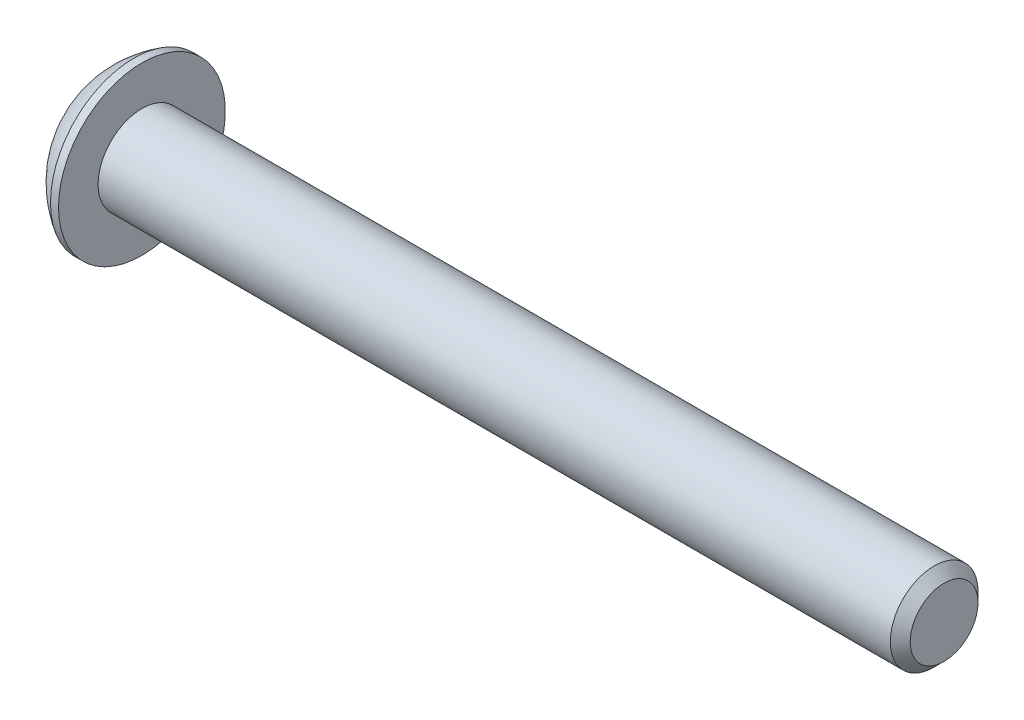
ISO-10303-21;
HEADER;
FILE_DESCRIPTION(('STEP AP214'),'2;1');
FILE_NAME('part.step','',(''),(''),'','','');
FILE_SCHEMA(('AUTOMOTIVE_DESIGN { 1 0 10303 214 1 1 1 1 }'));
ENDSEC;
DATA;
#1=APPLICATION_CONTEXT('core data for automotive mechanical design processes');
#2=APPLICATION_PROTOCOL_DEFINITION('international standard','automotive_design',2000,#1);
#3=PRODUCT_CONTEXT('',#1,'mechanical');
#4=PRODUCT('Part','Part','',(#3));
#5=PRODUCT_RELATED_PRODUCT_CATEGORY('part','',(#4));
#6=PRODUCT_DEFINITION_FORMATION('','',#4);
#7=PRODUCT_DEFINITION_CONTEXT('part definition',#1,'design');
#8=PRODUCT_DEFINITION('design','',#6,#7);
#9=PRODUCT_DEFINITION_SHAPE('','',#8);
#10=(LENGTH_UNIT() NAMED_UNIT(*) SI_UNIT(.MILLI.,.METRE.));
#11=(NAMED_UNIT(*) PLANE_ANGLE_UNIT() SI_UNIT($,.RADIAN.));
#12=(NAMED_UNIT(*) SI_UNIT($,.STERADIAN.) SOLID_ANGLE_UNIT());
#13=UNCERTAINTY_MEASURE_WITH_UNIT(LENGTH_MEASURE(1.E-05),#10,'distance_accuracy_value','');
#14=(GEOMETRIC_REPRESENTATION_CONTEXT(3) GLOBAL_UNCERTAINTY_ASSIGNED_CONTEXT((#13)) GLOBAL_UNIT_ASSIGNED_CONTEXT((#10,
#11,#12)) REPRESENTATION_CONTEXT('',''));
#15=CARTESIAN_POINT('',(0.,0.,0.));
#16=DIRECTION('',(0.,0.,1.));
#17=DIRECTION('',(1.,0.,0.));
#18=AXIS2_PLACEMENT_3D('',#15,#16,#17);
#19=CARTESIAN_POINT('',(1.32080000000034,0.,0.));
#20=DIRECTION('',(-1.,0.,0.));
#21=DIRECTION('',(0.,0.,1.));
#22=AXIS2_PLACEMENT_3D('',#19,#20,#21);
#23=CONICAL_SURFACE('',#22,1.1937999999998,1.04719755119608);
#24=CARTESIAN_POINT('',(2.01004075135902,0.,4.44089209850063E-13));
#25=VERTEX_POINT('',#24);
#26=VERTEX_LOOP('',#25);
#27=FACE_BOUND('',#26,.T.);
#28=CARTESIAN_POINT('',(1.32080000000009,0.,0.));
#29=DIRECTION('',(-1.,0.,0.));
#30=DIRECTION('',(0.,0.,1.));
#31=AXIS2_PLACEMENT_3D('',#28,#29,#30);
#32=CIRCLE('',#31,1.19380000000024);
#33=CARTESIAN_POINT('',(1.32080000000004,-1.03386112703797,0.59690000000006));
#34=VERTEX_POINT('',#33);
#35=CARTESIAN_POINT('',(1.32080000000004,0.,1.19380000000012));
#36=VERTEX_POINT('',#35);
#37=EDGE_CURVE('E20',#34,#36,#32,.T.);
#38=ORIENTED_EDGE('',*,*,#37,.T.);
#39=CARTESIAN_POINT('',(1.32080000000009,0.,0.));
#40=DIRECTION('',(-1.,0.,0.));
#41=DIRECTION('',(0.,0.,1.));
#42=AXIS2_PLACEMENT_3D('',#39,#40,#41);
#43=CIRCLE('',#42,1.19380000000024);
#44=CARTESIAN_POINT('',(1.32080000000004,1.03386112703797,0.596900000000061));
#45=VERTEX_POINT('',#44);
#46=EDGE_CURVE('E148',#36,#45,#43,.T.);
#47=ORIENTED_EDGE('',*,*,#46,.T.);
#48=CARTESIAN_POINT('',(1.32080000000009,0.,0.));
#49=DIRECTION('',(-1.,0.,0.));
#50=DIRECTION('',(0.,0.,1.));
#51=AXIS2_PLACEMENT_3D('',#48,#49,#50);
#52=CIRCLE('',#51,1.19380000000024);
#53=CARTESIAN_POINT('',(1.32080000000004,1.03386112703797,-0.596900000000061));
#54=VERTEX_POINT('',#53);
#55=EDGE_CURVE('E448',#45,#54,#52,.T.);
#56=ORIENTED_EDGE('',*,*,#55,.T.);
#57=CARTESIAN_POINT('',(1.32080000000009,0.,0.));
#58=DIRECTION('',(-1.,0.,0.));
#59=DIRECTION('',(0.,0.,1.));
#60=AXIS2_PLACEMENT_3D('',#57,#58,#59);
#61=CIRCLE('',#60,1.19380000000024);
#62=CARTESIAN_POINT('',(1.32080000000004,1.49457637585666E-12,-1.19380000000012));
#63=VERTEX_POINT('',#62);
#64=EDGE_CURVE('E449',#54,#63,#61,.T.);
#65=ORIENTED_EDGE('',*,*,#64,.T.);
#66=CARTESIAN_POINT('',(1.32080000000009,0.,0.));
#67=DIRECTION('',(-1.,0.,0.));
#68=DIRECTION('',(0.,0.,1.));
#69=AXIS2_PLACEMENT_3D('',#66,#67,#68);
#70=CIRCLE('',#69,1.19380000000024);
#71=CARTESIAN_POINT('',(1.32080000000004,-1.03386112703797,-0.59690000000006));
#72=VERTEX_POINT('',#71);
#73=EDGE_CURVE('E93',#63,#72,#70,.T.);
#74=ORIENTED_EDGE('',*,*,#73,.T.);
#75=CARTESIAN_POINT('',(1.32080000000009,0.,0.));
#76=DIRECTION('',(-1.,0.,0.));
#77=DIRECTION('',(0.,0.,1.));
#78=AXIS2_PLACEMENT_3D('',#75,#76,#77);
#79=CIRCLE('',#78,1.19380000000024);
#80=EDGE_CURVE('E89',#72,#34,#79,.T.);
#81=ORIENTED_EDGE('',*,*,#80,.T.);
#82=EDGE_LOOP('',(#38,#47,#56,#65,#74,#81));
#83=FACE_BOUND('',#82,.T.);
#84=ADVANCED_FACE('F17',(#27,#83),#23,.F.);
#85=CARTESIAN_POINT('',(1.3208,-2.06772225407572,-1.1938));
#86=DIRECTION('',(1.,0.,0.));
#87=DIRECTION('',(0.,0.,-1.));
#88=AXIS2_PLACEMENT_3D('',#85,#86,#87);
#89=PLANE('',#88);
#90=DIRECTION('',(0.,0.5,0.866025403784439));
#91=VECTOR('',#90,1.);
#92=CARTESIAN_POINT('',(1.3208,-1.37848150271715,0.));
#93=LINE('',#92,#91);
#94=CARTESIAN_POINT('',(1.3208,-0.689240751358574,1.1938));
#95=VERTEX_POINT('',#94);
#96=EDGE_CURVE('E101',#95,#34,#93,.F.);
#97=ORIENTED_EDGE('',*,*,#96,.F.);
#98=DIRECTION('',(0.,1.,0.));
#99=VECTOR('',#98,1.);
#100=CARTESIAN_POINT('',(1.3208,-0.689240751358574,1.1938));
#101=LINE('',#100,#99);
#102=EDGE_CURVE('E103',#36,#95,#101,.F.);
#103=ORIENTED_EDGE('',*,*,#102,.F.);
#104=ORIENTED_EDGE('',*,*,#37,.F.);
#105=EDGE_LOOP('',(#97,#103,#104));
#106=FACE_BOUND('',#105,.T.);
#107=ADVANCED_FACE('F99',(#106),#89,.F.);
#108=CARTESIAN_POINT('',(1.3208,-2.06772225407572,-1.1938));
#109=DIRECTION('',(1.,0.,0.));
#110=DIRECTION('',(0.,0.,-1.));
#111=AXIS2_PLACEMENT_3D('',#108,#109,#110);
#112=PLANE('',#111);
#113=DIRECTION('',(0.,-0.5,0.866025403784439));
#114=VECTOR('',#113,1.);
#115=CARTESIAN_POINT('',(1.3208,-0.689240751358574,-1.1938));
#116=LINE('',#115,#114);
#117=CARTESIAN_POINT('',(1.3208,-1.37848150271715,0.));
#118=VERTEX_POINT('',#117);
#119=EDGE_CURVE('E109',#118,#72,#116,.F.);
#120=ORIENTED_EDGE('',*,*,#119,.F.);
#121=DIRECTION('',(0.,0.5,0.866025403784439));
#122=VECTOR('',#121,1.);
#123=CARTESIAN_POINT('',(1.3208,-1.37848150271715,0.));
#124=LINE('',#123,#122);
#125=EDGE_CURVE('E106',#34,#118,#124,.F.);
#126=ORIENTED_EDGE('',*,*,#125,.F.);
#127=ORIENTED_EDGE('',*,*,#80,.F.);
#128=EDGE_LOOP('',(#120,#126,#127));
#129=FACE_BOUND('',#128,.T.);
#130=ADVANCED_FACE('F107',(#129),#112,.F.);
#131=CARTESIAN_POINT('',(1.3208,-2.06772225407572,-1.1938));
#132=DIRECTION('',(1.,0.,0.));
#133=DIRECTION('',(0.,0.,-1.));
#134=AXIS2_PLACEMENT_3D('',#131,#132,#133);
#135=PLANE('',#134);
#136=DIRECTION('',(0.,1.,0.));
#137=VECTOR('',#136,1.);
#138=CARTESIAN_POINT('',(1.3208,0.689240751358577,-1.1938));
#139=LINE('',#138,#137);
#140=CARTESIAN_POINT('',(1.3208,-0.689240751358574,-1.1938));
#141=VERTEX_POINT('',#140);
#142=EDGE_CURVE('E419',#141,#63,#139,.T.);
#143=ORIENTED_EDGE('',*,*,#142,.F.);
#144=DIRECTION('',(0.,-0.5,0.866025403784439));
#145=VECTOR('',#144,1.);
#146=CARTESIAN_POINT('',(1.3208,-0.689240751358574,-1.1938));
#147=LINE('',#146,#145);
#148=EDGE_CURVE('E431',#72,#141,#147,.F.);
#149=ORIENTED_EDGE('',*,*,#148,.F.);
#150=ORIENTED_EDGE('',*,*,#73,.F.);
#151=EDGE_LOOP('',(#143,#149,#150));
#152=FACE_BOUND('',#151,.T.);
#153=ADVANCED_FACE('F191',(#152),#135,.F.);
#154=CARTESIAN_POINT('',(1.3208,-2.06772225407572,-1.1938));
#155=DIRECTION('',(1.,0.,0.));
#156=DIRECTION('',(0.,0.,-1.));
#157=AXIS2_PLACEMENT_3D('',#154,#155,#156);
#158=PLANE('',#157);
#159=DIRECTION('',(0.,-0.5,-0.866025403784439));
#160=VECTOR('',#159,1.);
#161=CARTESIAN_POINT('',(1.3208,1.37848150271715,0.));
#162=LINE('',#161,#160);
#163=CARTESIAN_POINT('',(1.3208,0.689240751358577,-1.1938));
#164=VERTEX_POINT('',#163);
#165=EDGE_CURVE('E405',#164,#54,#162,.F.);
#166=ORIENTED_EDGE('',*,*,#165,.F.);
#167=DIRECTION('',(0.,1.,0.));
#168=VECTOR('',#167,1.);
#169=CARTESIAN_POINT('',(1.3208,0.689240751358577,-1.1938));
#170=LINE('',#169,#168);
#171=EDGE_CURVE('E416',#63,#164,#170,.T.);
#172=ORIENTED_EDGE('',*,*,#171,.F.);
#173=ORIENTED_EDGE('',*,*,#64,.F.);
#174=EDGE_LOOP('',(#166,#172,#173));
#175=FACE_BOUND('',#174,.T.);
#176=ADVANCED_FACE('F187',(#175),#158,.F.);
#177=CARTESIAN_POINT('',(1.3208,-2.06772225407572,-1.1938));
#178=DIRECTION('',(1.,0.,0.));
#179=DIRECTION('',(0.,0.,-1.));
#180=AXIS2_PLACEMENT_3D('',#177,#178,#179);
#181=PLANE('',#180);
#182=DIRECTION('',(0.,0.5,-0.866025403784439));
#183=VECTOR('',#182,1.);
#184=CARTESIAN_POINT('',(1.3208,0.689240751358576,1.1938));
#185=LINE('',#184,#183);
#186=CARTESIAN_POINT('',(1.3208,1.37848150271715,0.));
#187=VERTEX_POINT('',#186);
#188=EDGE_CURVE('E384',#187,#45,#185,.F.);
#189=ORIENTED_EDGE('',*,*,#188,.F.);
#190=DIRECTION('',(0.,-0.5,-0.866025403784439));
#191=VECTOR('',#190,1.);
#192=CARTESIAN_POINT('',(1.3208,1.37848150271715,0.));
#193=LINE('',#192,#191);
#194=EDGE_CURVE('E403',#54,#187,#193,.F.);
#195=ORIENTED_EDGE('',*,*,#194,.F.);
#196=ORIENTED_EDGE('',*,*,#55,.F.);
#197=EDGE_LOOP('',(#189,#195,#196));
#198=FACE_BOUND('',#197,.T.);
#199=ADVANCED_FACE('F183',(#198),#181,.F.);
#200=CARTESIAN_POINT('',(1.3208,-2.06772225407572,-1.1938));
#201=DIRECTION('',(1.,0.,0.));
#202=DIRECTION('',(0.,0.,-1.));
#203=AXIS2_PLACEMENT_3D('',#200,#201,#202);
#204=PLANE('',#203);
#205=DIRECTION('',(0.,1.,0.));
#206=VECTOR('',#205,1.);
#207=CARTESIAN_POINT('',(1.3208,-0.689240751358574,1.1938));
#208=LINE('',#207,#206);
#209=CARTESIAN_POINT('',(1.3208,0.689240751358576,1.1938));
#210=VERTEX_POINT('',#209);
#211=EDGE_CURVE('E118',#210,#36,#208,.F.);
#212=ORIENTED_EDGE('',*,*,#211,.F.);
#213=DIRECTION('',(0.,0.5,-0.866025403784439));
#214=VECTOR('',#213,1.);
#215=CARTESIAN_POINT('',(1.3208,0.689240751358576,1.1938));
#216=LINE('',#215,#214);
#217=EDGE_CURVE('E387',#45,#210,#216,.F.);
#218=ORIENTED_EDGE('',*,*,#217,.F.);
#219=ORIENTED_EDGE('',*,*,#46,.F.);
#220=EDGE_LOOP('',(#212,#218,#219));
#221=FACE_BOUND('',#220,.T.);
#222=ADVANCED_FACE('F179',(#221),#204,.F.);
#223=CARTESIAN_POINT('',(1.3208,-0.689240751358574,1.1938));
#224=DIRECTION('',(0.,0.,-1.));
#225=DIRECTION('',(0.,1.,0.));
#226=AXIS2_PLACEMENT_3D('',#223,#224,#225);
#227=PLANE('',#226);
#228=DIRECTION('',(0.,1.,0.));
#229=VECTOR('',#228,1.);
#230=CARTESIAN_POINT('',(0.,0.,1.1938));
#231=LINE('',#230,#229);
#232=CARTESIAN_POINT('',(0.,0.689240751358577,1.1938));
#233=VERTEX_POINT('',#232);
#234=CARTESIAN_POINT('',(0.,-0.689240751358574,1.1938));
#235=VERTEX_POINT('',#234);
#236=EDGE_CURVE('E381',#233,#235,#231,.F.);
#237=ORIENTED_EDGE('',*,*,#236,.F.);
#238=DIRECTION('',(1.,0.,0.));
#239=VECTOR('',#238,1.);
#240=CARTESIAN_POINT('',(1.3208,0.689240751358576,1.1938));
#241=LINE('',#240,#239);
#242=EDGE_CURVE('E393',#210,#233,#241,.F.);
#243=ORIENTED_EDGE('',*,*,#242,.F.);
#244=ORIENTED_EDGE('',*,*,#211,.T.);
#245=ORIENTED_EDGE('',*,*,#102,.T.);
#246=DIRECTION('',(1.,0.,0.));
#247=VECTOR('',#246,1.);
#248=CARTESIAN_POINT('',(1.3208,-0.689240751358574,1.1938));
#249=LINE('',#248,#247);
#250=EDGE_CURVE('E112',#235,#95,#249,.T.);
#251=ORIENTED_EDGE('',*,*,#250,.F.);
#252=EDGE_LOOP('',(#237,#243,#244,#245,#251));
#253=FACE_BOUND('',#252,.T.);
#254=ADVANCED_FACE('F176',(#253),#227,.T.);
#255=CARTESIAN_POINT('',(1.3208,-1.37848150271715,0.));
#256=DIRECTION('',(0.,0.866025403784439,-0.5));
#257=DIRECTION('',(0.,0.5,0.866025403784439));
#258=AXIS2_PLACEMENT_3D('',#255,#256,#257);
#259=PLANE('',#258);
#260=DIRECTION('',(0.,-0.5,-0.866025403784439));
#261=VECTOR('',#260,1.);
#262=CARTESIAN_POINT('',(0.,-0.689240751358574,1.1938));
#263=LINE('',#262,#261);
#264=CARTESIAN_POINT('',(0.,-1.37848150271715,0.));
#265=VERTEX_POINT('',#264);
#266=EDGE_CURVE('E378',#235,#265,#263,.T.);
#267=ORIENTED_EDGE('',*,*,#266,.F.);
#268=ORIENTED_EDGE('',*,*,#250,.T.);
#269=ORIENTED_EDGE('',*,*,#96,.T.);
#270=ORIENTED_EDGE('',*,*,#125,.T.);
#271=DIRECTION('',(1.,0.,0.));
#272=VECTOR('',#271,1.);
#273=CARTESIAN_POINT('',(1.3208,-1.37848150271715,0.));
#274=LINE('',#273,#272);
#275=EDGE_CURVE('E428',#265,#118,#274,.T.);
#276=ORIENTED_EDGE('',*,*,#275,.F.);
#277=EDGE_LOOP('',(#267,#268,#269,#270,#276));
#278=FACE_BOUND('',#277,.T.);
#279=ADVANCED_FACE('F116',(#278),#259,.T.);
#280=CARTESIAN_POINT('',(1.3208,-0.689240751358574,-1.1938));
#281=DIRECTION('',(0.,0.866025403784439,0.5));
#282=DIRECTION('',(0.,-0.5,0.866025403784439));
#283=AXIS2_PLACEMENT_3D('',#280,#281,#282);
#284=PLANE('',#283);
#285=DIRECTION('',(0.,0.5,-0.866025403784439));
#286=VECTOR('',#285,1.);
#287=CARTESIAN_POINT('',(0.,-1.37848150271715,0.));
#288=LINE('',#287,#286);
#289=CARTESIAN_POINT('',(0.,-0.689240751358574,-1.1938));
#290=VERTEX_POINT('',#289);
#291=EDGE_CURVE('E375',#265,#290,#288,.T.);
#292=ORIENTED_EDGE('',*,*,#291,.F.);
#293=ORIENTED_EDGE('',*,*,#275,.T.);
#294=ORIENTED_EDGE('',*,*,#119,.T.);
#295=ORIENTED_EDGE('',*,*,#148,.T.);
#296=DIRECTION('',(1.,0.,0.));
#297=VECTOR('',#296,1.);
#298=CARTESIAN_POINT('',(1.3208,-0.689240751358574,-1.1938));
#299=LINE('',#298,#297);
#300=EDGE_CURVE('E413',#290,#141,#299,.T.);
#301=ORIENTED_EDGE('',*,*,#300,.F.);
#302=EDGE_LOOP('',(#292,#293,#294,#295,#301));
#303=FACE_BOUND('',#302,.T.);
#304=ADVANCED_FACE('F169',(#303),#284,.T.);
#305=CARTESIAN_POINT('',(1.3208,0.689240751358577,-1.1938));
#306=DIRECTION('',(0.,0.,1.));
#307=DIRECTION('',(1.,0.,0.));
#308=AXIS2_PLACEMENT_3D('',#305,#306,#307);
#309=PLANE('',#308);
#310=DIRECTION('',(0.,1.,0.));
#311=VECTOR('',#310,1.);
#312=CARTESIAN_POINT('',(0.,0.,-1.1938));
#313=LINE('',#312,#311);
#314=CARTESIAN_POINT('',(0.,0.689240751358577,-1.1938));
#315=VERTEX_POINT('',#314);
#316=EDGE_CURVE('E372',#290,#315,#313,.T.);
#317=ORIENTED_EDGE('',*,*,#316,.F.);
#318=ORIENTED_EDGE('',*,*,#300,.T.);
#319=ORIENTED_EDGE('',*,*,#142,.T.);
#320=ORIENTED_EDGE('',*,*,#171,.T.);
#321=DIRECTION('',(1.,0.,0.));
#322=VECTOR('',#321,1.);
#323=CARTESIAN_POINT('',(1.3208,0.689240751358577,-1.1938));
#324=LINE('',#323,#322);
#325=EDGE_CURVE('E388',#315,#164,#324,.T.);
#326=ORIENTED_EDGE('',*,*,#325,.F.);
#327=EDGE_LOOP('',(#317,#318,#319,#320,#326));
#328=FACE_BOUND('',#327,.T.);
#329=ADVANCED_FACE('F166',(#328),#309,.T.);
#330=CARTESIAN_POINT('',(1.3208,1.37848150271715,0.));
#331=DIRECTION('',(0.,-0.866025403784439,0.5));
#332=DIRECTION('',(0.,-0.5,-0.866025403784439));
#333=AXIS2_PLACEMENT_3D('',#330,#331,#332);
#334=PLANE('',#333);
#335=DIRECTION('',(0.,0.5,0.866025403784439));
#336=VECTOR('',#335,1.);
#337=CARTESIAN_POINT('',(0.,0.689240751358577,-1.1938));
#338=LINE('',#337,#336);
#339=CARTESIAN_POINT('',(0.,1.37848150271715,0.));
#340=VERTEX_POINT('',#339);
#341=EDGE_CURVE('E369',#315,#340,#338,.T.);
#342=ORIENTED_EDGE('',*,*,#341,.F.);
#343=ORIENTED_EDGE('',*,*,#325,.T.);
#344=ORIENTED_EDGE('',*,*,#165,.T.);
#345=ORIENTED_EDGE('',*,*,#194,.T.);
#346=DIRECTION('',(1.,0.,0.));
#347=VECTOR('',#346,1.);
#348=CARTESIAN_POINT('',(1.3208,1.37848150271715,0.));
#349=LINE('',#348,#347);
#350=EDGE_CURVE('E35',#340,#187,#349,.T.);
#351=ORIENTED_EDGE('',*,*,#350,.F.);
#352=EDGE_LOOP('',(#342,#343,#344,#345,#351));
#353=FACE_BOUND('',#352,.T.);
#354=ADVANCED_FACE('F162',(#353),#334,.T.);
#355=CARTESIAN_POINT('',(1.3208,0.689240751358576,1.1938));
#356=DIRECTION('',(0.,-0.866025403784439,-0.5));
#357=DIRECTION('',(0.,0.5,-0.866025403784439));
#358=AXIS2_PLACEMENT_3D('',#355,#356,#357);
#359=PLANE('',#358);
#360=DIRECTION('',(0.,-0.5,0.866025403784439));
#361=VECTOR('',#360,1.);
#362=CARTESIAN_POINT('',(0.,1.37848150271715,0.));
#363=LINE('',#362,#361);
#364=EDGE_CURVE('E147',#340,#233,#363,.T.);
#365=ORIENTED_EDGE('',*,*,#364,.F.);
#366=ORIENTED_EDGE('',*,*,#350,.T.);
#367=ORIENTED_EDGE('',*,*,#188,.T.);
#368=ORIENTED_EDGE('',*,*,#217,.T.);
#369=ORIENTED_EDGE('',*,*,#242,.T.);
#370=EDGE_LOOP('',(#365,#366,#367,#368,#369));
#371=FACE_BOUND('',#370,.T.);
#372=ADVANCED_FACE('F158',(#371),#359,.T.);
#373=CARTESIAN_POINT('',(0.,0.,0.));
#374=DIRECTION('',(-1.,0.,0.));
#375=DIRECTION('',(0.,0.,1.));
#376=AXIS2_PLACEMENT_3D('',#373,#374,#375);
#377=PLANE('',#376);
#378=ORIENTED_EDGE('',*,*,#341,.T.);
#379=ORIENTED_EDGE('',*,*,#364,.T.);
#380=ORIENTED_EDGE('',*,*,#236,.T.);
#381=ORIENTED_EDGE('',*,*,#266,.T.);
#382=ORIENTED_EDGE('',*,*,#291,.T.);
#383=ORIENTED_EDGE('',*,*,#316,.T.);
#384=EDGE_LOOP('',(#378,#379,#380,#381,#382,#383));
#385=FACE_BOUND('',#384,.T.);
#386=CARTESIAN_POINT('',(0.,1.9812,0.));
#387=CARTESIAN_POINT('',(0.,1.9811996664299,0.0556258831179428));
#388=CARTESIAN_POINT('',(0.,1.97885520380442,0.111261989398606));
#389=CARTESIAN_POINT('',(0.,1.96949260169541,0.222149719830458));
#390=CARTESIAN_POINT('',(0.,1.96247308239605,0.277401225602895));
#391=CARTESIAN_POINT('',(0.,1.94379192841038,0.387209508139747));
#392=CARTESIAN_POINT('',(-1.85325793235264E-13,1.93212292489526,0.441765039546365));
#393=CARTESIAN_POINT('',(1.86344214223505E-13,1.90422331175315,0.549729449347493));
#394=CARTESIAN_POINT('',(6.94543371897454E-13,1.88798900035338,0.603137359208869));
#395=CARTESIAN_POINT('',(1.15501975216981E-12,1.83266214476501,0.760839131321828));
#396=CARTESIAN_POINT('',(0.,1.78690023648845,0.862876433575429));
#397=CARTESIAN_POINT('',(0.,1.67887358150667,1.05780719540872));
#398=CARTESIAN_POINT('',(9.54193214892627E-13,1.6166082074585,1.15070030720801));
#399=CARTESIAN_POINT('',(5.94805591894675E-13,1.51224157140982,1.28116890915697));
#400=CARTESIAN_POINT('',(1.63221293851378E-13,1.4755970394354,1.32320451127026));
#401=CARTESIAN_POINT('',(-1.62196980336157E-13,1.39893832619713,1.40400288695709));
#402=CARTESIAN_POINT('',(0.,1.35892742784698,1.44276877695455));
#403=CARTESIAN_POINT('',(1.14362537325405E-13,1.23416504602197,1.55382272417904));
#404=CARTESIAN_POINT('',(0.,1.14466125559859,1.62089527952111));
#405=CARTESIAN_POINT('',(0.,0.955712144178167,1.7390221808118));
#406=CARTESIAN_POINT('',(0.,0.856267198233564,1.79007713076007));
#407=CARTESIAN_POINT('',(0.,0.650206345910843,1.87477637530954));
#408=CARTESIAN_POINT('',(0.,0.543590516134855,1.90842085586267));
#409=CARTESIAN_POINT('',(0.,0.326226155292018,1.95733039300656));
#410=CARTESIAN_POINT('',(0.,0.21547760215793,1.97259535144288));
#411=CARTESIAN_POINT('',(0.,-0.00701040587544639,1.98431697865418));
#412=CARTESIAN_POINT('',(0.,-0.118749860774734,1.98077364742917));
#413=CARTESIAN_POINT('',(0.,-0.340050178355485,1.95497485623825));
#414=CARTESIAN_POINT('',(0.,-0.449611052668255,1.93271949620218));
#415=CARTESIAN_POINT('',(0.,-0.663431110729174,1.87014138774523));
#416=CARTESIAN_POINT('',(0.,-0.76769023783852,1.82981844635272));
#417=CARTESIAN_POINT('',(0.,-0.968005760719347,1.73219968377096));
#418=CARTESIAN_POINT('',(0.,-1.0640618469811,1.6749032225164));
#419=CARTESIAN_POINT('',(0.,-1.19980276751283,1.57757371205873));
#420=CARTESIAN_POINT('',(0.,-1.24366557129213,1.54322665019466));
#421=CARTESIAN_POINT('',(0.,-1.32838995706696,1.47093063174264));
#422=CARTESIAN_POINT('',(0.,-1.36924860178706,1.43297823102439));
#423=CARTESIAN_POINT('',(0.,-1.48674671849223,1.31419842051173));
#424=CARTESIAN_POINT('',(0.,-1.55842832343237,1.22836221289311));
#425=CARTESIAN_POINT('',(0.,-1.6863396856475,1.04586168272493));
#426=CARTESIAN_POINT('',(0.,-1.7425700302488,0.949197771949774));
#427=CARTESIAN_POINT('',(0.,-1.8141614250401,0.798182600298684));
#428=CARTESIAN_POINT('',(0.,-1.83591780585875,0.746776203847791));
#429=CARTESIAN_POINT('',(0.,-1.87500754181092,0.642341081688636));
#430=CARTESIAN_POINT('',(0.,-1.89234447645404,0.589313708122847));
#431=CARTESIAN_POINT('',(0.,-1.92246053433554,0.482076273028395));
#432=CARTESIAN_POINT('',(0.,-1.93524685475118,0.42786822425751));
#433=CARTESIAN_POINT('',(0.,-1.95620937250494,0.318578151844611));
#434=CARTESIAN_POINT('',(0.,-1.96438692958147,0.263496390912872));
#435=CARTESIAN_POINT('',(0.,-1.97388528284653,0.173607715038558));
#436=CARTESIAN_POINT('',(0.,-1.97662743364426,0.138944718024998));
#437=CARTESIAN_POINT('',(0.,-1.98028489645283,0.0695224782567002));
#438=CARTESIAN_POINT('',(0.,-1.98120020846367,0.0347632355019631));
#439=CARTESIAN_POINT('',(0.,-1.9811996664299,-0.0556258831179437));
#440=CARTESIAN_POINT('',(0.,-1.97885520380442,-0.111261989398607));
#441=CARTESIAN_POINT('',(0.,-1.96949260169541,-0.222149719830459));
#442=CARTESIAN_POINT('',(0.,-1.96247308239605,-0.277401225602897));
#443=CARTESIAN_POINT('',(0.,-1.94379192841039,-0.387209508139749));
#444=CARTESIAN_POINT('',(-1.85269749640691E-13,-1.93212292489526,-0.441765039546367));
#445=CARTESIAN_POINT('',(1.86288125054388E-13,-1.90422331175315,-0.549729449347495));
#446=CARTESIAN_POINT('',(6.94525090263764E-13,-1.88798900035338,-0.603137359208872));
#447=CARTESIAN_POINT('',(1.15505622829081E-12,-1.83266214476501,-0.760839131321831));
#448=CARTESIAN_POINT('',(0.,-1.78690023648845,-0.862876433575431));
#449=CARTESIAN_POINT('',(0.,-1.67887358150667,-1.05780719540872));
#450=CARTESIAN_POINT('',(9.54248812869379E-13,-1.6166082074585,-1.15070030720801));
#451=CARTESIAN_POINT('',(5.94777756479239E-13,-1.51224157140982,-1.28116890915698));
#452=CARTESIAN_POINT('',(1.63138949183833E-13,-1.47559703943539,-1.32320451127027));
#453=CARTESIAN_POINT('',(-1.62114715061273E-13,-1.39893832619713,-1.40400288695709));
#454=CARTESIAN_POINT('',(0.,-1.35892742784699,-1.44276877695455));
#455=CARTESIAN_POINT('',(1.13760489124207E-13,-1.23416504602197,-1.55382272417904));
#456=CARTESIAN_POINT('',(0.,-1.14466125559859,-1.62089527952111));
#457=CARTESIAN_POINT('',(0.,-0.95571214417816,-1.73902218081179));
#458=CARTESIAN_POINT('',(0.,-0.856267198233559,-1.79007713076007));
#459=CARTESIAN_POINT('',(0.,-0.650206345910841,-1.87477637530954));
#460=CARTESIAN_POINT('',(0.,-0.543590516134854,-1.90842085586267));
#461=CARTESIAN_POINT('',(0.,-0.326226155292018,-1.95733039300657));
#462=CARTESIAN_POINT('',(0.,-0.215477602157929,-1.97259535144288));
#463=CARTESIAN_POINT('',(0.,0.0070104058754487,-1.98431697865418));
#464=CARTESIAN_POINT('',(0.,0.118749860774737,-1.98077364742916));
#465=CARTESIAN_POINT('',(0.,0.340050178355489,-1.95497485623824));
#466=CARTESIAN_POINT('',(0.,0.44961105266826,-1.93271949620218));
#467=CARTESIAN_POINT('',(0.,0.663431110729178,-1.87014138774524));
#468=CARTESIAN_POINT('',(0.,0.767690237838524,-1.82981844635272));
#469=CARTESIAN_POINT('',(0.,0.968005760719348,-1.73219968377096));
#470=CARTESIAN_POINT('',(0.,1.0640618469811,-1.67490322251639));
#471=CARTESIAN_POINT('',(0.,1.19980276751283,-1.57757371205873));
#472=CARTESIAN_POINT('',(0.,1.24366557129214,-1.54322665019465));
#473=CARTESIAN_POINT('',(0.,1.32838995706696,-1.47093063174263));
#474=CARTESIAN_POINT('',(0.,1.36924860178706,-1.43297823102439));
#475=CARTESIAN_POINT('',(0.,1.48674671849223,-1.31419842051172));
#476=CARTESIAN_POINT('',(0.,1.55842832343237,-1.22836221289311));
#477=CARTESIAN_POINT('',(0.,1.6863396856475,-1.04586168272492));
#478=CARTESIAN_POINT('',(0.,1.7425700302488,-0.949197771949768));
#479=CARTESIAN_POINT('',(0.,1.8141614250401,-0.798182600298677));
#480=CARTESIAN_POINT('',(0.,1.83591780585875,-0.746776203847785));
#481=CARTESIAN_POINT('',(0.,1.87500754181092,-0.64234108168863));
#482=CARTESIAN_POINT('',(0.,1.89234447645404,-0.589313708122841));
#483=CARTESIAN_POINT('',(0.,1.92246053433555,-0.482076273028389));
#484=CARTESIAN_POINT('',(0.,1.93524685475118,-0.427868224257505));
#485=CARTESIAN_POINT('',(0.,1.95620937250494,-0.318578151844605));
#486=CARTESIAN_POINT('',(0.,1.96438692958147,-0.263496390912866));
#487=CARTESIAN_POINT('',(0.,1.97388528284653,-0.173607715038553));
#488=CARTESIAN_POINT('',(0.,1.97662743364426,-0.138944718024994));
#489=CARTESIAN_POINT('',(0.,1.98028489645283,-0.0695224782566989));
#490=CARTESIAN_POINT('',(0.,1.98120020846367,-0.034763235501963));
#491=CARTESIAN_POINT('',(0.,1.9812,0.));
#492=B_SPLINE_CURVE_WITH_KNOTS('',3,(#386,#387,#388,#389,#390,#391,#392,#393,#394,#395,#396,
#397,#398,#399,#400,#401,#402,#403,#404,#405,#406,#407,#408,#409,#410,#411,#412,#413,#414,#415,
#416,#417,#418,#419,#420,#421,#422,#423,#424,#425,#426,#427,#428,#429,#430,#431,#432,#433,#434,
#435,#436,#437,#438,#439,#440,#441,#442,#443,#444,#445,#446,#447,#448,#449,#450,#451,#452,#453,
#454,#455,#456,#457,#458,#459,#460,#461,#462,#463,#464,#465,#466,#467,#468,#469,#470,#471,#472,
#473,#474,#475,#476,#477,#478,#479,#480,#481,#482,#483,#484,#485,#486,#487,#488,#489,#490,#491),
.UNSPECIFIED.,.T.,.F.,(4,2,2,2,2,2,2,2,2,2,2,2,2,2,2,2,2,2,2,2,2,2,2,2,2,2,2,2,2,2,2,2,2,2,2,2,
2,2,2,2,2,2,2,2,2,2,2,2,2,2,2,2,4),(0.,0.166845646007828,0.333740557374255,0.500901034367693,
0.668197445942386,1.00199278686282,1.33580081809885,1.50292354032982,1.6698851310853,
2.00370118900129,2.33750465770544,2.67130456115909,3.005106247238,3.33890793331696,
3.67270783677065,4.00651130547476,4.34032736339026,4.50728895414554,4.67441167637632,
5.00821970761259,5.34201504853332,5.50931146010827,5.67647193710191,5.84336684846844,
6.0102124944764,6.11448220058334,6.21875190669029,6.38559755269812,6.55249246406454,
6.71965294105798,6.88694935263268,7.22074469355311,7.55455272478915,7.72167544702011,
7.88863703777559,8.22245309569158,8.55625656439573,8.89005646784938,9.2238581539283,
9.55765984000725,9.89145974346094,10.2252632121651,10.5590792700806,10.7260408608358,
10.8931635830666,11.2269716143029,11.5607669552236,11.7280633667986,11.8952238437922,
12.0621187551587,12.2289644011667,12.3332341072736,12.4375038133806),.UNSPECIFIED.);
#493=CARTESIAN_POINT('',(0.,1.9812,0.));
#494=VERTEX_POINT('',#493);
#495=EDGE_CURVE('E140',#494,#494,#492,.T.);
#496=ORIENTED_EDGE('',*,*,#495,.F.);
#497=EDGE_LOOP('',(#496));
#498=FACE_BOUND('',#497,.T.);
#499=ADVANCED_FACE('F154',(#385,#498),#377,.T.);
#500=CARTESIAN_POINT('',(4.13385,0.,0.));
#501=DIRECTION('',(0.,1.,0.));
#502=DIRECTION('',(1.,0.,0.));
#503=AXIS2_PLACEMENT_3D('',#500,#501,#502);
#504=SPHERICAL_SURFACE('',#503,4.58408870578439);
#505=CARTESIAN_POINT('',(1.8288,0.,0.));
#506=DIRECTION('',(-1.,0.,0.));
#507=DIRECTION('',(0.,0.,1.));
#508=AXIS2_PLACEMENT_3D('',#505,#506,#507);
#509=CIRCLE('',#508,3.9624);
#510=CARTESIAN_POINT('',(1.8288,0.,3.9624));
#511=VERTEX_POINT('',#510);
#512=EDGE_CURVE('E137',#511,#511,#509,.F.);
#513=ORIENTED_EDGE('',*,*,#512,.F.);
#514=EDGE_LOOP('',(#513));
#515=FACE_BOUND('',#514,.T.);
#516=ORIENTED_EDGE('',*,*,#495,.T.);
#517=EDGE_LOOP('',(#516));
#518=FACE_BOUND('',#517,.T.);
#519=ADVANCED_FACE('F150',(#515,#518),#504,.T.);
#520=CARTESIAN_POINT('',(40.3098,0.,0.));
#521=DIRECTION('',(-1.,0.,0.));
#522=DIRECTION('',(0.,0.,1.));
#523=AXIS2_PLACEMENT_3D('',#520,#521,#522);
#524=PLANE('',#523);
#525=CARTESIAN_POINT('',(40.3097999999886,0.,0.));
#526=DIRECTION('',(-1.,0.,0.));
#527=DIRECTION('',(0.,0.,1.));
#528=AXIS2_PLACEMENT_3D('',#525,#526,#527);
#529=CIRCLE('',#528,1.61036000002923);
#530=CARTESIAN_POINT('',(40.3097999999886,0.,1.61036000002923));
#531=VERTEX_POINT('',#530);
#532=EDGE_CURVE('E134',#531,#531,#529,.T.);
#533=ORIENTED_EDGE('',*,*,#532,.F.);
#534=EDGE_LOOP('',(#533));
#535=FACE_BOUND('',#534,.T.);
#536=ADVANCED_FACE('F221',(#535),#524,.F.);
#537=CARTESIAN_POINT('',(0.,0.,0.));
#538=DIRECTION('',(-1.,0.,0.));
#539=DIRECTION('',(0.,0.,1.));
#540=AXIS2_PLACEMENT_3D('',#537,#538,#539);
#541=CYLINDRICAL_SURFACE('',#540,3.9624);
#542=ORIENTED_EDGE('',*,*,#512,.T.);
#543=EDGE_LOOP('',(#542));
#544=FACE_BOUND('',#543,.T.);
#545=CARTESIAN_POINT('',(2.2098,0.,0.));
#546=DIRECTION('',(-1.,0.,0.));
#547=DIRECTION('',(0.,0.,1.));
#548=AXIS2_PLACEMENT_3D('',#545,#546,#547);
#549=CIRCLE('',#548,3.9624);
#550=CARTESIAN_POINT('',(2.2098,0.,3.9624));
#551=VERTEX_POINT('',#550);
#552=EDGE_CURVE('E131',#551,#551,#549,.T.);
#553=ORIENTED_EDGE('',*,*,#552,.T.);
#554=EDGE_LOOP('',(#553));
#555=FACE_BOUND('',#554,.T.);
#556=ADVANCED_FACE('F218',(#544,#555),#541,.T.);
#557=CARTESIAN_POINT('',(39.8373600000923,0.,0.));
#558=DIRECTION('',(-1.,0.,0.));
#559=DIRECTION('',(0.,0.,1.));
#560=AXIS2_PLACEMENT_3D('',#557,#558,#559);
#561=CONICAL_SURFACE('',#560,2.08279999992556,0.785398163397448);
#562=CARTESIAN_POINT('',(39.83736,0.,0.));
#563=DIRECTION('',(-1.,0.,0.));
#564=DIRECTION('',(0.,0.,1.));
#565=AXIS2_PLACEMENT_3D('',#562,#563,#564);
#566=CIRCLE('',#565,2.0828);
#567=CARTESIAN_POINT('',(39.83736,0.,2.0828));
#568=VERTEX_POINT('',#567);
#569=EDGE_CURVE('E26',#568,#568,#566,.T.);
#570=ORIENTED_EDGE('',*,*,#569,.F.);
#571=EDGE_LOOP('',(#570));
#572=FACE_BOUND('',#571,.T.);
#573=ORIENTED_EDGE('',*,*,#532,.T.);
#574=EDGE_LOOP('',(#573));
#575=FACE_BOUND('',#574,.T.);
#576=ADVANCED_FACE('F211',(#572,#575),#561,.T.);
#577=CARTESIAN_POINT('',(2.2098,2.0828,0.));
#578=DIRECTION('',(-1.,0.,0.));
#579=DIRECTION('',(0.,0.,1.));
#580=AXIS2_PLACEMENT_3D('',#577,#578,#579);
#581=PLANE('',#580);
#582=CARTESIAN_POINT('',(2.2098,0.,0.));
#583=DIRECTION('',(-1.,0.,0.));
#584=DIRECTION('',(0.,0.,1.));
#585=AXIS2_PLACEMENT_3D('',#582,#583,#584);
#586=CIRCLE('',#585,2.0828);
#587=CARTESIAN_POINT('',(2.2098,0.,2.0828));
#588=VERTEX_POINT('',#587);
#589=EDGE_CURVE('E10',#588,#588,#586,.F.);
#590=ORIENTED_EDGE('',*,*,#589,.F.);
#591=EDGE_LOOP('',(#590));
#592=FACE_BOUND('',#591,.T.);
#593=ORIENTED_EDGE('',*,*,#552,.F.);
#594=EDGE_LOOP('',(#593));
#595=FACE_BOUND('',#594,.T.);
#596=ADVANCED_FACE('F205',(#592,#595),#581,.F.);
#597=CARTESIAN_POINT('',(0.,0.,0.));
#598=DIRECTION('',(-1.,0.,0.));
#599=DIRECTION('',(0.,0.,1.));
#600=AXIS2_PLACEMENT_3D('',#597,#598,#599);
#601=CYLINDRICAL_SURFACE('',#600,2.0828);
#602=ORIENTED_EDGE('',*,*,#589,.T.);
#603=EDGE_LOOP('',(#602));
#604=FACE_BOUND('',#603,.T.);
#605=ORIENTED_EDGE('',*,*,#569,.T.);
#606=EDGE_LOOP('',(#605));
#607=FACE_BOUND('',#606,.T.);
#608=ADVANCED_FACE('F203',(#604,#607),#601,.T.);
#609=CLOSED_SHELL('',(#84,#107,#130,#153,#176,#199,#222,#254,#279,#304,#329,#354,#372,#499,#519,
#536,#556,#576,#596,#608));
#610=MANIFOLD_SOLID_BREP('B1',#609);
#611=ADVANCED_BREP_SHAPE_REPRESENTATION('',(#18,#610),#14);
#612=SHAPE_DEFINITION_REPRESENTATION(#9,#611);
ENDSEC;
END-ISO-10303-21;
